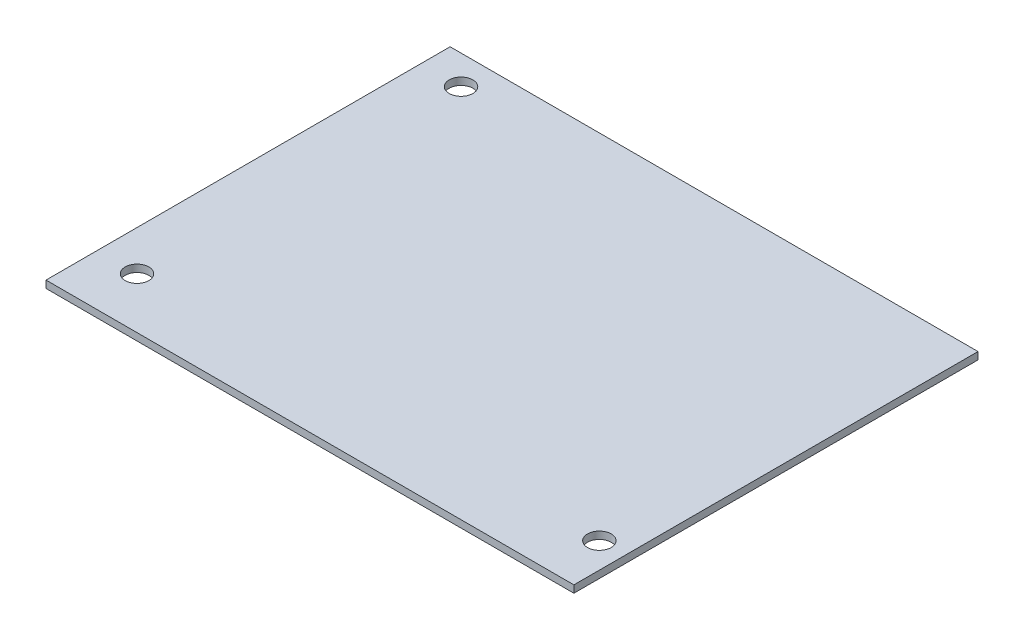
ISO-10303-21;
HEADER;
FILE_DESCRIPTION(('STEP AP214'),'2;1');
FILE_NAME('part.step','',(''),(''),'','','');
FILE_SCHEMA(('AUTOMOTIVE_DESIGN { 1 0 10303 214 1 1 1 1 }'));
ENDSEC;
DATA;
#1=APPLICATION_CONTEXT('core data for automotive mechanical design processes');
#2=APPLICATION_PROTOCOL_DEFINITION('international standard','automotive_design',2000,#1);
#3=PRODUCT_CONTEXT('',#1,'mechanical');
#4=PRODUCT('Part','Part','',(#3));
#5=PRODUCT_RELATED_PRODUCT_CATEGORY('part','',(#4));
#6=PRODUCT_DEFINITION_FORMATION('','',#4);
#7=PRODUCT_DEFINITION_CONTEXT('part definition',#1,'design');
#8=PRODUCT_DEFINITION('design','',#6,#7);
#9=PRODUCT_DEFINITION_SHAPE('','',#8);
#10=(LENGTH_UNIT() NAMED_UNIT(*) SI_UNIT(.MILLI.,.METRE.));
#11=(NAMED_UNIT(*) PLANE_ANGLE_UNIT() SI_UNIT($,.RADIAN.));
#12=(NAMED_UNIT(*) SI_UNIT($,.STERADIAN.) SOLID_ANGLE_UNIT());
#13=UNCERTAINTY_MEASURE_WITH_UNIT(LENGTH_MEASURE(1.E-05),#10,'distance_accuracy_value','');
#14=(GEOMETRIC_REPRESENTATION_CONTEXT(3) GLOBAL_UNCERTAINTY_ASSIGNED_CONTEXT((#13)) GLOBAL_UNIT_ASSIGNED_CONTEXT((#10,
#11,#12)) REPRESENTATION_CONTEXT('',''));
#15=CARTESIAN_POINT('',(0.,0.,0.));
#16=DIRECTION('',(0.,0.,1.));
#17=DIRECTION('',(1.,0.,0.));
#18=AXIS2_PLACEMENT_3D('',#15,#16,#17);
#19=CARTESIAN_POINT('',(0.,2.,0.));
#20=DIRECTION('',(0.,1.,0.));
#21=DIRECTION('',(0.,0.,1.));
#22=AXIS2_PLACEMENT_3D('',#19,#20,#21);
#23=PLANE('',#22);
#24=CARTESIAN_POINT('',(-7.,2.,-14.));
#25=DIRECTION('',(0.,1.,0.));
#26=DIRECTION('',(0.,0.,1.));
#27=AXIS2_PLACEMENT_3D('',#24,#25,#26);
#28=CIRCLE('',#27,3.25);
#29=CARTESIAN_POINT('',(-7.,2.,-10.75));
#30=VERTEX_POINT('',#29);
#31=EDGE_CURVE('E140',#30,#30,#28,.T.);
#32=ORIENTED_EDGE('',*,*,#31,.F.);
#33=EDGE_LOOP('',(#32));
#34=FACE_BOUND('',#33,.T.);
#35=DIRECTION('',(0.,0.,-1.));
#36=VECTOR('',#35,1.);
#37=CARTESIAN_POINT('',(0.,2.,0.));
#38=LINE('',#37,#36);
#39=CARTESIAN_POINT('',(0.,2.,0.));
#40=VERTEX_POINT('',#39);
#41=CARTESIAN_POINT('',(0.,2.,-111.));
#42=VERTEX_POINT('',#41);
#43=EDGE_CURVE('E98',#40,#42,#38,.T.);
#44=ORIENTED_EDGE('',*,*,#43,.T.);
#45=DIRECTION('',(-1.,0.,0.));
#46=VECTOR('',#45,1.);
#47=CARTESIAN_POINT('',(0.,2.,-111.));
#48=LINE('',#47,#46);
#49=CARTESIAN_POINT('',(-145.,2.,-111.));
#50=VERTEX_POINT('',#49);
#51=EDGE_CURVE('E93',#42,#50,#48,.T.);
#52=ORIENTED_EDGE('',*,*,#51,.T.);
#53=DIRECTION('',(0.,0.,1.));
#54=VECTOR('',#53,1.);
#55=CARTESIAN_POINT('',(-145.,2.,0.));
#56=LINE('',#55,#54);
#57=CARTESIAN_POINT('',(-145.,2.,0.));
#58=VERTEX_POINT('',#57);
#59=EDGE_CURVE('E96',#50,#58,#56,.T.);
#60=ORIENTED_EDGE('',*,*,#59,.T.);
#61=DIRECTION('',(1.,0.,0.));
#62=VECTOR('',#61,1.);
#63=CARTESIAN_POINT('',(0.,2.,0.));
#64=LINE('',#63,#62);
#65=EDGE_CURVE('E63',#58,#40,#64,.T.);
#66=ORIENTED_EDGE('',*,*,#65,.T.);
#67=EDGE_LOOP('',(#44,#52,#60,#66));
#68=FACE_BOUND('',#67,.T.);
#69=CARTESIAN_POINT('',(-134.,2.,-14.));
#70=DIRECTION('',(0.,1.,0.));
#71=DIRECTION('',(0.,0.,1.));
#72=AXIS2_PLACEMENT_3D('',#69,#70,#71);
#73=CIRCLE('',#72,3.25000000000001);
#74=CARTESIAN_POINT('',(-134.,2.,-10.75));
#75=VERTEX_POINT('',#74);
#76=EDGE_CURVE('E118',#75,#75,#73,.T.);
#77=ORIENTED_EDGE('',*,*,#76,.F.);
#78=EDGE_LOOP('',(#77));
#79=FACE_BOUND('',#78,.T.);
#80=CARTESIAN_POINT('',(-134.,2.,-103.));
#81=DIRECTION('',(0.,1.,0.));
#82=DIRECTION('',(0.,0.,1.));
#83=AXIS2_PLACEMENT_3D('',#80,#81,#82);
#84=CIRCLE('',#83,3.25000000000001);
#85=CARTESIAN_POINT('',(-134.,2.,-99.75));
#86=VERTEX_POINT('',#85);
#87=EDGE_CURVE('E148',#86,#86,#84,.T.);
#88=ORIENTED_EDGE('',*,*,#87,.F.);
#89=EDGE_LOOP('',(#88));
#90=FACE_BOUND('',#89,.T.);
#91=ADVANCED_FACE('F45',(#34,#68,#79,#90),#23,.T.);
#92=CARTESIAN_POINT('',(0.,0.,0.));
#93=DIRECTION('',(0.,1.,0.));
#94=DIRECTION('',(0.,0.,1.));
#95=AXIS2_PLACEMENT_3D('',#92,#93,#94);
#96=PLANE('',#95);
#97=DIRECTION('',(0.,0.,-1.));
#98=VECTOR('',#97,1.);
#99=CARTESIAN_POINT('',(0.,0.,0.));
#100=LINE('',#99,#98);
#101=CARTESIAN_POINT('',(0.,0.,0.));
#102=VERTEX_POINT('',#101);
#103=CARTESIAN_POINT('',(0.,0.,-111.));
#104=VERTEX_POINT('',#103);
#105=EDGE_CURVE('E114',#102,#104,#100,.T.);
#106=ORIENTED_EDGE('',*,*,#105,.F.);
#107=DIRECTION('',(1.,0.,0.));
#108=VECTOR('',#107,1.);
#109=CARTESIAN_POINT('',(0.,0.,0.));
#110=LINE('',#109,#108);
#111=CARTESIAN_POINT('',(-145.,0.,0.));
#112=VERTEX_POINT('',#111);
#113=EDGE_CURVE('E86',#112,#102,#110,.T.);
#114=ORIENTED_EDGE('',*,*,#113,.F.);
#115=DIRECTION('',(0.,0.,1.));
#116=VECTOR('',#115,1.);
#117=CARTESIAN_POINT('',(-145.,0.,0.));
#118=LINE('',#117,#116);
#119=CARTESIAN_POINT('',(-145.,0.,-111.));
#120=VERTEX_POINT('',#119);
#121=EDGE_CURVE('E80',#120,#112,#118,.T.);
#122=ORIENTED_EDGE('',*,*,#121,.F.);
#123=DIRECTION('',(-1.,0.,0.));
#124=VECTOR('',#123,1.);
#125=CARTESIAN_POINT('',(0.,0.,-111.));
#126=LINE('',#125,#124);
#127=EDGE_CURVE('E103',#104,#120,#126,.T.);
#128=ORIENTED_EDGE('',*,*,#127,.F.);
#129=EDGE_LOOP('',(#106,#114,#122,#128));
#130=FACE_BOUND('',#129,.T.);
#131=CARTESIAN_POINT('',(-134.,0.,-14.));
#132=DIRECTION('',(0.,1.,0.));
#133=DIRECTION('',(0.,0.,1.));
#134=AXIS2_PLACEMENT_3D('',#131,#132,#133);
#135=CIRCLE('',#134,3.25000000000001);
#136=CARTESIAN_POINT('',(-134.,0.,-10.75));
#137=VERTEX_POINT('',#136);
#138=EDGE_CURVE('E136',#137,#137,#135,.T.);
#139=ORIENTED_EDGE('',*,*,#138,.T.);
#140=EDGE_LOOP('',(#139));
#141=FACE_BOUND('',#140,.T.);
#142=CARTESIAN_POINT('',(-7.,0.,-14.));
#143=DIRECTION('',(0.,1.,0.));
#144=DIRECTION('',(0.,0.,1.));
#145=AXIS2_PLACEMENT_3D('',#142,#143,#144);
#146=CIRCLE('',#145,3.25);
#147=CARTESIAN_POINT('',(-7.,0.,-10.75));
#148=VERTEX_POINT('',#147);
#149=EDGE_CURVE('E144',#148,#148,#146,.T.);
#150=ORIENTED_EDGE('',*,*,#149,.T.);
#151=EDGE_LOOP('',(#150));
#152=FACE_BOUND('',#151,.T.);
#153=CARTESIAN_POINT('',(-134.,0.,-103.));
#154=DIRECTION('',(0.,1.,0.));
#155=DIRECTION('',(0.,0.,1.));
#156=AXIS2_PLACEMENT_3D('',#153,#154,#155);
#157=CIRCLE('',#156,3.25000000000001);
#158=CARTESIAN_POINT('',(-134.,0.,-99.75));
#159=VERTEX_POINT('',#158);
#160=EDGE_CURVE('E152',#159,#159,#157,.T.);
#161=ORIENTED_EDGE('',*,*,#160,.T.);
#162=EDGE_LOOP('',(#161));
#163=FACE_BOUND('',#162,.T.);
#164=ADVANCED_FACE('F131',(#130,#141,#152,#163),#96,.F.);
#165=CARTESIAN_POINT('',(0.,2.,0.));
#166=DIRECTION('',(-1.,0.,0.));
#167=DIRECTION('',(0.,0.,1.));
#168=AXIS2_PLACEMENT_3D('',#165,#166,#167);
#169=PLANE('',#168);
#170=ORIENTED_EDGE('',*,*,#105,.T.);
#171=DIRECTION('',(0.,-1.,0.));
#172=VECTOR('',#171,1.);
#173=CARTESIAN_POINT('',(0.,2.,-111.));
#174=LINE('',#173,#172);
#175=EDGE_CURVE('E11',#42,#104,#174,.T.);
#176=ORIENTED_EDGE('',*,*,#175,.F.);
#177=ORIENTED_EDGE('',*,*,#43,.F.);
#178=DIRECTION('',(0.,-1.,0.));
#179=VECTOR('',#178,1.);
#180=CARTESIAN_POINT('',(0.,2.,0.));
#181=LINE('',#180,#179);
#182=EDGE_CURVE('E110',#40,#102,#181,.T.);
#183=ORIENTED_EDGE('',*,*,#182,.T.);
#184=EDGE_LOOP('',(#170,#176,#177,#183));
#185=FACE_BOUND('',#184,.T.);
#186=ADVANCED_FACE('F47',(#185),#169,.F.);
#187=CARTESIAN_POINT('',(0.,2.,-111.));
#188=DIRECTION('',(0.,0.,1.));
#189=DIRECTION('',(1.,0.,0.));
#190=AXIS2_PLACEMENT_3D('',#187,#188,#189);
#191=PLANE('',#190);
#192=ORIENTED_EDGE('',*,*,#127,.T.);
#193=DIRECTION('',(0.,-1.,0.));
#194=VECTOR('',#193,1.);
#195=CARTESIAN_POINT('',(-145.,2.,-111.));
#196=LINE('',#195,#194);
#197=EDGE_CURVE('E55',#50,#120,#196,.T.);
#198=ORIENTED_EDGE('',*,*,#197,.F.);
#199=ORIENTED_EDGE('',*,*,#51,.F.);
#200=ORIENTED_EDGE('',*,*,#175,.T.);
#201=EDGE_LOOP('',(#192,#198,#199,#200));
#202=FACE_BOUND('',#201,.T.);
#203=ADVANCED_FACE('F102',(#202),#191,.F.);
#204=CARTESIAN_POINT('',(-145.,2.,0.));
#205=DIRECTION('',(1.,0.,0.));
#206=DIRECTION('',(0.,0.,-1.));
#207=AXIS2_PLACEMENT_3D('',#204,#205,#206);
#208=PLANE('',#207);
#209=ORIENTED_EDGE('',*,*,#121,.T.);
#210=DIRECTION('',(0.,-1.,0.));
#211=VECTOR('',#210,1.);
#212=CARTESIAN_POINT('',(-145.,2.,0.));
#213=LINE('',#212,#211);
#214=EDGE_CURVE('E105',#58,#112,#213,.T.);
#215=ORIENTED_EDGE('',*,*,#214,.F.);
#216=ORIENTED_EDGE('',*,*,#59,.F.);
#217=ORIENTED_EDGE('',*,*,#197,.T.);
#218=EDGE_LOOP('',(#209,#215,#216,#217));
#219=FACE_BOUND('',#218,.T.);
#220=ADVANCED_FACE('F106',(#219),#208,.F.);
#221=CARTESIAN_POINT('',(0.,2.,0.));
#222=DIRECTION('',(0.,0.,-1.));
#223=DIRECTION('',(-1.,0.,0.));
#224=AXIS2_PLACEMENT_3D('',#221,#222,#223);
#225=PLANE('',#224);
#226=ORIENTED_EDGE('',*,*,#113,.T.);
#227=ORIENTED_EDGE('',*,*,#182,.F.);
#228=ORIENTED_EDGE('',*,*,#65,.F.);
#229=ORIENTED_EDGE('',*,*,#214,.T.);
#230=EDGE_LOOP('',(#226,#227,#228,#229));
#231=FACE_BOUND('',#230,.T.);
#232=ADVANCED_FACE('F128',(#231),#225,.F.);
#233=CARTESIAN_POINT('',(-134.,2.,-14.));
#234=DIRECTION('',(0.,-1.,0.));
#235=DIRECTION('',(0.,0.,-1.));
#236=AXIS2_PLACEMENT_3D('',#233,#234,#235);
#237=CYLINDRICAL_SURFACE('',#236,3.25000000000001);
#238=ORIENTED_EDGE('',*,*,#76,.T.);
#239=EDGE_LOOP('',(#238));
#240=FACE_BOUND('',#239,.T.);
#241=ORIENTED_EDGE('',*,*,#138,.F.);
#242=EDGE_LOOP('',(#241));
#243=FACE_BOUND('',#242,.T.);
#244=ADVANCED_FACE('F172',(#240,#243),#237,.F.);
#245=CARTESIAN_POINT('',(-7.,2.,-14.));
#246=DIRECTION('',(0.,-1.,0.));
#247=DIRECTION('',(0.,0.,-1.));
#248=AXIS2_PLACEMENT_3D('',#245,#246,#247);
#249=CYLINDRICAL_SURFACE('',#248,3.25);
#250=ORIENTED_EDGE('',*,*,#31,.T.);
#251=EDGE_LOOP('',(#250));
#252=FACE_BOUND('',#251,.T.);
#253=ORIENTED_EDGE('',*,*,#149,.F.);
#254=EDGE_LOOP('',(#253));
#255=FACE_BOUND('',#254,.T.);
#256=ADVANCED_FACE('F217',(#252,#255),#249,.F.);
#257=CARTESIAN_POINT('',(-134.,2.,-103.));
#258=DIRECTION('',(0.,-1.,0.));
#259=DIRECTION('',(0.,0.,-1.));
#260=AXIS2_PLACEMENT_3D('',#257,#258,#259);
#261=CYLINDRICAL_SURFACE('',#260,3.25000000000001);
#262=ORIENTED_EDGE('',*,*,#87,.T.);
#263=EDGE_LOOP('',(#262));
#264=FACE_BOUND('',#263,.T.);
#265=ORIENTED_EDGE('',*,*,#160,.F.);
#266=EDGE_LOOP('',(#265));
#267=FACE_BOUND('',#266,.T.);
#268=ADVANCED_FACE('F160',(#264,#267),#261,.F.);
#269=CLOSED_SHELL('',(#91,#164,#186,#203,#220,#232,#244,#256,#268));
#270=MANIFOLD_SOLID_BREP('B2',#269);
#271=ADVANCED_BREP_SHAPE_REPRESENTATION('',(#18,#270),#14);
#272=SHAPE_DEFINITION_REPRESENTATION(#9,#271);
ENDSEC;
END-ISO-10303-21;
